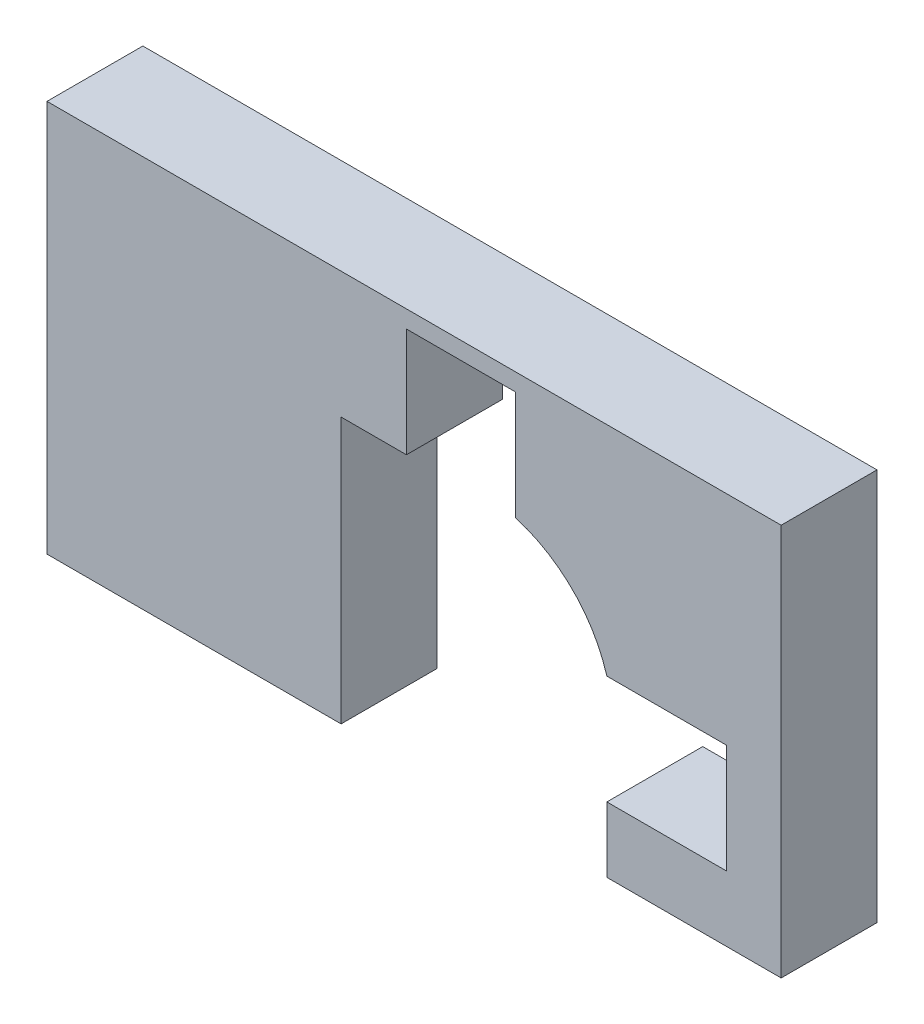
ISO-10303-21;
HEADER;
FILE_DESCRIPTION(('STEP AP214'),'2;1');
FILE_NAME('part.step','',(''),(''),'','','');
FILE_SCHEMA(('AUTOMOTIVE_DESIGN { 1 0 10303 214 1 1 1 1 }'));
ENDSEC;
DATA;
#1=APPLICATION_CONTEXT('core data for automotive mechanical design processes');
#2=APPLICATION_PROTOCOL_DEFINITION('international standard','automotive_design',2000,#1);
#3=PRODUCT_CONTEXT('',#1,'mechanical');
#4=PRODUCT('Part','Part','',(#3));
#5=PRODUCT_RELATED_PRODUCT_CATEGORY('part','',(#4));
#6=PRODUCT_DEFINITION_FORMATION('','',#4);
#7=PRODUCT_DEFINITION_CONTEXT('part definition',#1,'design');
#8=PRODUCT_DEFINITION('design','',#6,#7);
#9=PRODUCT_DEFINITION_SHAPE('','',#8);
#10=(LENGTH_UNIT() NAMED_UNIT(*) SI_UNIT(.MILLI.,.METRE.));
#11=(NAMED_UNIT(*) PLANE_ANGLE_UNIT() SI_UNIT($,.RADIAN.));
#12=(NAMED_UNIT(*) SI_UNIT($,.STERADIAN.) SOLID_ANGLE_UNIT());
#13=UNCERTAINTY_MEASURE_WITH_UNIT(LENGTH_MEASURE(1.E-05),#10,'distance_accuracy_value','');
#14=(GEOMETRIC_REPRESENTATION_CONTEXT(3) GLOBAL_UNCERTAINTY_ASSIGNED_CONTEXT((#13)) GLOBAL_UNIT_ASSIGNED_CONTEXT((#10,
#11,#12)) REPRESENTATION_CONTEXT('',''));
#15=CARTESIAN_POINT('',(0.,0.,0.));
#16=DIRECTION('',(0.,0.,1.));
#17=DIRECTION('',(1.,0.,0.));
#18=AXIS2_PLACEMENT_3D('',#15,#16,#17);
#19=CARTESIAN_POINT('',(-62.5162371902122,-41.3859564980179,44.));
#20=DIRECTION('',(0.,1.,0.));
#21=DIRECTION('',(-1.,0.,0.));
#22=AXIS2_PLACEMENT_3D('',#19,#20,#21);
#23=PLANE('',#22);
#24=DIRECTION('',(1.,0.,0.));
#25=VECTOR('',#24,1.);
#26=CARTESIAN_POINT('',(-62.5162371902122,-41.3859564980179,0.));
#27=LINE('',#26,#25);
#28=CARTESIAN_POINT('',(-197.516237190212,-41.385956498018,0.));
#29=VERTEX_POINT('',#28);
#30=CARTESIAN_POINT('',(-62.5162371902122,-41.3859564980179,0.));
#31=VERTEX_POINT('',#30);
#32=EDGE_CURVE('E171',#29,#31,#27,.T.);
#33=ORIENTED_EDGE('',*,*,#32,.T.);
#34=DIRECTION('',(0.,0.,-1.));
#35=VECTOR('',#34,1.);
#36=CARTESIAN_POINT('',(-62.5162371902122,-41.3859564980179,44.));
#37=LINE('',#36,#35);
#38=CARTESIAN_POINT('',(-62.5162371902122,-41.3859564980179,44.));
#39=VERTEX_POINT('',#38);
#40=EDGE_CURVE('E11',#39,#31,#37,.T.);
#41=ORIENTED_EDGE('',*,*,#40,.F.);
#42=DIRECTION('',(1.,0.,0.));
#43=VECTOR('',#42,1.);
#44=CARTESIAN_POINT('',(-62.5162371902122,-41.3859564980179,44.));
#45=LINE('',#44,#43);
#46=CARTESIAN_POINT('',(-197.516237190212,-41.385956498018,44.));
#47=VERTEX_POINT('',#46);
#48=EDGE_CURVE('E199',#47,#39,#45,.T.);
#49=ORIENTED_EDGE('',*,*,#48,.F.);
#50=DIRECTION('',(0.,0.,-1.));
#51=VECTOR('',#50,1.);
#52=CARTESIAN_POINT('',(-197.516237190212,-41.385956498018,44.));
#53=LINE('',#52,#51);
#54=EDGE_CURVE('E167',#47,#29,#53,.T.);
#55=ORIENTED_EDGE('',*,*,#54,.T.);
#56=EDGE_LOOP('',(#33,#41,#49,#55));
#57=FACE_BOUND('',#56,.T.);
#58=ADVANCED_FACE('F33',(#57),#23,.F.);
#59=CARTESIAN_POINT('',(-62.5162371902122,-41.3859564980179,44.));
#60=DIRECTION('',(-1.,0.,0.));
#61=DIRECTION('',(0.,0.,1.));
#62=AXIS2_PLACEMENT_3D('',#59,#60,#61);
#63=PLANE('',#62);
#64=DIRECTION('',(0.,1.,0.));
#65=VECTOR('',#64,1.);
#66=CARTESIAN_POINT('',(-62.5162371902122,-41.3859564980179,0.));
#67=LINE('',#66,#65);
#68=CARTESIAN_POINT('',(-62.5162371902122,80.6140435019821,0.));
#69=VERTEX_POINT('',#68);
#70=EDGE_CURVE('E174',#31,#69,#67,.T.);
#71=ORIENTED_EDGE('',*,*,#70,.T.);
#72=DIRECTION('',(0.,0.,-1.));
#73=VECTOR('',#72,1.);
#74=CARTESIAN_POINT('',(-62.5162371902122,80.6140435019821,44.));
#75=LINE('',#74,#73);
#76=CARTESIAN_POINT('',(-62.5162371902122,80.6140435019821,44.));
#77=VERTEX_POINT('',#76);
#78=EDGE_CURVE('E41',#77,#69,#75,.T.);
#79=ORIENTED_EDGE('',*,*,#78,.F.);
#80=DIRECTION('',(0.,1.,0.));
#81=VECTOR('',#80,1.);
#82=CARTESIAN_POINT('',(-62.5162371902122,-41.3859564980179,44.));
#83=LINE('',#82,#81);
#84=EDGE_CURVE('E113',#39,#77,#83,.T.);
#85=ORIENTED_EDGE('',*,*,#84,.F.);
#86=ORIENTED_EDGE('',*,*,#40,.T.);
#87=EDGE_LOOP('',(#71,#79,#85,#86));
#88=FACE_BOUND('',#87,.T.);
#89=ADVANCED_FACE('F292',(#88),#63,.F.);
#90=CARTESIAN_POINT('',(-62.5162371902122,80.6140435019821,44.));
#91=DIRECTION('',(0.,1.,0.));
#92=DIRECTION('',(-1.,0.,0.));
#93=AXIS2_PLACEMENT_3D('',#90,#91,#92);
#94=PLANE('',#93);
#95=DIRECTION('',(1.,0.,0.));
#96=VECTOR('',#95,1.);
#97=CARTESIAN_POINT('',(-62.5162371902122,80.6140435019821,0.));
#98=LINE('',#97,#96);
#99=CARTESIAN_POINT('',(-32.5162371902122,80.6140435019821,0.));
#100=VERTEX_POINT('',#99);
#101=EDGE_CURVE('E176',#69,#100,#98,.T.);
#102=ORIENTED_EDGE('',*,*,#101,.T.);
#103=DIRECTION('',(0.,0.,-1.));
#104=VECTOR('',#103,1.);
#105=CARTESIAN_POINT('',(-32.5162371902122,80.6140435019821,44.));
#106=LINE('',#105,#104);
#107=CARTESIAN_POINT('',(-32.5162371902122,80.6140435019821,44.));
#108=VERTEX_POINT('',#107);
#109=EDGE_CURVE('E227',#108,#100,#106,.T.);
#110=ORIENTED_EDGE('',*,*,#109,.F.);
#111=DIRECTION('',(1.,0.,0.));
#112=VECTOR('',#111,1.);
#113=CARTESIAN_POINT('',(-62.5162371902122,80.6140435019821,44.));
#114=LINE('',#113,#112);
#115=EDGE_CURVE('E235',#77,#108,#114,.T.);
#116=ORIENTED_EDGE('',*,*,#115,.F.);
#117=ORIENTED_EDGE('',*,*,#78,.T.);
#118=EDGE_LOOP('',(#102,#110,#116,#117));
#119=FACE_BOUND('',#118,.T.);
#120=ADVANCED_FACE('F233',(#119),#94,.F.);
#121=CARTESIAN_POINT('',(-32.5162371902123,130.614043501982,44.));
#122=DIRECTION('',(-1.,0.,0.));
#123=DIRECTION('',(0.,-1.,0.));
#124=AXIS2_PLACEMENT_3D('',#121,#122,#123);
#125=PLANE('',#124);
#126=DIRECTION('',(0.,1.,0.));
#127=VECTOR('',#126,1.);
#128=CARTESIAN_POINT('',(-32.5162371902123,130.614043501982,0.));
#129=LINE('',#128,#127);
#130=CARTESIAN_POINT('',(-32.5162371902123,130.614043501982,0.));
#131=VERTEX_POINT('',#130);
#132=EDGE_CURVE('E178',#100,#131,#129,.T.);
#133=ORIENTED_EDGE('',*,*,#132,.T.);
#134=DIRECTION('',(0.,0.,-1.));
#135=VECTOR('',#134,1.);
#136=CARTESIAN_POINT('',(-32.5162371902123,130.614043501982,44.));
#137=LINE('',#136,#135);
#138=CARTESIAN_POINT('',(-32.5162371902123,130.614043501982,44.));
#139=VERTEX_POINT('',#138);
#140=EDGE_CURVE('E224',#139,#131,#137,.T.);
#141=ORIENTED_EDGE('',*,*,#140,.F.);
#142=DIRECTION('',(0.,1.,0.));
#143=VECTOR('',#142,1.);
#144=CARTESIAN_POINT('',(-32.5162371902123,130.614043501982,44.));
#145=LINE('',#144,#143);
#146=EDGE_CURVE('E253',#108,#139,#145,.T.);
#147=ORIENTED_EDGE('',*,*,#146,.F.);
#148=ORIENTED_EDGE('',*,*,#109,.T.);
#149=EDGE_LOOP('',(#133,#141,#147,#148));
#150=FACE_BOUND('',#149,.T.);
#151=ADVANCED_FACE('F244',(#150),#125,.F.);
#152=CARTESIAN_POINT('',(-32.5162371902123,130.614043501982,44.));
#153=DIRECTION('',(0.,1.,0.));
#154=DIRECTION('',(-1.,0.,0.));
#155=AXIS2_PLACEMENT_3D('',#152,#153,#154);
#156=PLANE('',#155);
#157=DIRECTION('',(1.,0.,0.));
#158=VECTOR('',#157,1.);
#159=CARTESIAN_POINT('',(-32.5162371902123,130.614043501982,0.));
#160=LINE('',#159,#158);
#161=CARTESIAN_POINT('',(17.4837628097877,130.614043501982,0.));
#162=VERTEX_POINT('',#161);
#163=EDGE_CURVE('E180',#131,#162,#160,.T.);
#164=ORIENTED_EDGE('',*,*,#163,.T.);
#165=DIRECTION('',(0.,0.,-1.));
#166=VECTOR('',#165,1.);
#167=CARTESIAN_POINT('',(17.4837628097877,130.614043501982,44.));
#168=LINE('',#167,#166);
#169=CARTESIAN_POINT('',(17.4837628097877,130.614043501982,44.));
#170=VERTEX_POINT('',#169);
#171=EDGE_CURVE('E221',#170,#162,#168,.T.);
#172=ORIENTED_EDGE('',*,*,#171,.F.);
#173=DIRECTION('',(1.,0.,0.));
#174=VECTOR('',#173,1.);
#175=CARTESIAN_POINT('',(-32.5162371902123,130.614043501982,44.));
#176=LINE('',#175,#174);
#177=EDGE_CURVE('E250',#139,#170,#176,.T.);
#178=ORIENTED_EDGE('',*,*,#177,.F.);
#179=ORIENTED_EDGE('',*,*,#140,.T.);
#180=EDGE_LOOP('',(#164,#172,#178,#179));
#181=FACE_BOUND('',#180,.T.);
#182=ADVANCED_FACE('F248',(#181),#156,.F.);
#183=CARTESIAN_POINT('',(17.4837628097877,130.614043501982,44.));
#184=DIRECTION('',(1.,0.,0.));
#185=DIRECTION('',(0.,0.,-1.));
#186=AXIS2_PLACEMENT_3D('',#183,#184,#185);
#187=PLANE('',#186);
#188=DIRECTION('',(0.,-1.,0.));
#189=VECTOR('',#188,1.);
#190=CARTESIAN_POINT('',(17.4837628097877,130.614043501982,0.));
#191=LINE('',#190,#189);
#192=CARTESIAN_POINT('',(17.4837628097877,80.6140435019821,0.));
#193=VERTEX_POINT('',#192);
#194=EDGE_CURVE('E182',#162,#193,#191,.T.);
#195=ORIENTED_EDGE('',*,*,#194,.T.);
#196=DIRECTION('',(0.,0.,-1.));
#197=VECTOR('',#196,1.);
#198=CARTESIAN_POINT('',(17.4837628097877,80.6140435019821,44.));
#199=LINE('',#198,#197);
#200=CARTESIAN_POINT('',(17.4837628097877,80.6140435019821,44.));
#201=VERTEX_POINT('',#200);
#202=EDGE_CURVE('E218',#201,#193,#199,.T.);
#203=ORIENTED_EDGE('',*,*,#202,.F.);
#204=DIRECTION('',(0.,-1.,0.));
#205=VECTOR('',#204,1.);
#206=CARTESIAN_POINT('',(17.4837628097877,130.614043501982,44.));
#207=LINE('',#206,#205);
#208=EDGE_CURVE('E252',#170,#201,#207,.T.);
#209=ORIENTED_EDGE('',*,*,#208,.F.);
#210=ORIENTED_EDGE('',*,*,#171,.T.);
#211=EDGE_LOOP('',(#195,#203,#209,#210));
#212=FACE_BOUND('',#211,.T.);
#213=ADVANCED_FACE('F305',(#212),#187,.F.);
#214=CARTESIAN_POINT('',(0.,21.1302806921944,44.));
#215=DIRECTION('',(0.,0.,-1.));
#216=DIRECTION('',(-1.,0.,0.));
#217=AXIS2_PLACEMENT_3D('',#214,#215,#216);
#218=CYLINDRICAL_SURFACE('',#217,62.);
#219=CARTESIAN_POINT('',(0.,21.1302806921944,0.));
#220=DIRECTION('',(0.,0.,-1.));
#221=DIRECTION('',(-1.,0.,0.));
#222=AXIS2_PLACEMENT_3D('',#219,#220,#221);
#223=CIRCLE('',#222,62.);
#224=CARTESIAN_POINT('',(59.4837628097877,38.6140435019821,0.));
#225=VERTEX_POINT('',#224);
#226=EDGE_CURVE('E184',#193,#225,#223,.T.);
#227=ORIENTED_EDGE('',*,*,#226,.T.);
#228=DIRECTION('',(0.,0.,-1.));
#229=VECTOR('',#228,1.);
#230=CARTESIAN_POINT('',(59.4837628097877,38.6140435019821,44.));
#231=LINE('',#230,#229);
#232=CARTESIAN_POINT('',(59.4837628097877,38.6140435019821,44.));
#233=VERTEX_POINT('',#232);
#234=EDGE_CURVE('E215',#233,#225,#231,.T.);
#235=ORIENTED_EDGE('',*,*,#234,.F.);
#236=CARTESIAN_POINT('',(0.,21.1302806921944,44.));
#237=DIRECTION('',(0.,0.,-1.));
#238=DIRECTION('',(-1.,0.,0.));
#239=AXIS2_PLACEMENT_3D('',#236,#237,#238);
#240=CIRCLE('',#239,62.);
#241=EDGE_CURVE('E255',#201,#233,#240,.T.);
#242=ORIENTED_EDGE('',*,*,#241,.F.);
#243=ORIENTED_EDGE('',*,*,#202,.T.);
#244=EDGE_LOOP('',(#227,#235,#242,#243));
#245=FACE_BOUND('',#244,.T.);
#246=ADVANCED_FACE('F308',(#245),#218,.F.);
#247=CARTESIAN_POINT('',(59.4837628097877,38.6140435019821,44.));
#248=DIRECTION('',(0.,1.,0.));
#249=DIRECTION('',(-1.,0.,0.));
#250=AXIS2_PLACEMENT_3D('',#247,#248,#249);
#251=PLANE('',#250);
#252=DIRECTION('',(1.,0.,0.));
#253=VECTOR('',#252,1.);
#254=CARTESIAN_POINT('',(59.4837628097877,38.6140435019821,0.));
#255=LINE('',#254,#253);
#256=CARTESIAN_POINT('',(114.483762809788,38.6140435019821,0.));
#257=VERTEX_POINT('',#256);
#258=EDGE_CURVE('E186',#225,#257,#255,.T.);
#259=ORIENTED_EDGE('',*,*,#258,.T.);
#260=DIRECTION('',(0.,0.,-1.));
#261=VECTOR('',#260,1.);
#262=CARTESIAN_POINT('',(114.483762809788,38.6140435019821,44.));
#263=LINE('',#262,#261);
#264=CARTESIAN_POINT('',(114.483762809788,38.6140435019821,44.));
#265=VERTEX_POINT('',#264);
#266=EDGE_CURVE('E212',#265,#257,#263,.T.);
#267=ORIENTED_EDGE('',*,*,#266,.F.);
#268=DIRECTION('',(1.,0.,0.));
#269=VECTOR('',#268,1.);
#270=CARTESIAN_POINT('',(59.4837628097877,38.6140435019821,44.));
#271=LINE('',#270,#269);
#272=EDGE_CURVE('E261',#233,#265,#271,.T.);
#273=ORIENTED_EDGE('',*,*,#272,.F.);
#274=ORIENTED_EDGE('',*,*,#234,.T.);
#275=EDGE_LOOP('',(#259,#267,#273,#274));
#276=FACE_BOUND('',#275,.T.);
#277=ADVANCED_FACE('F312',(#276),#251,.F.);
#278=CARTESIAN_POINT('',(114.483762809788,38.6140435019821,44.));
#279=DIRECTION('',(1.,0.,0.));
#280=DIRECTION('',(0.,0.,-1.));
#281=AXIS2_PLACEMENT_3D('',#278,#279,#280);
#282=PLANE('',#281);
#283=DIRECTION('',(0.,-1.,0.));
#284=VECTOR('',#283,1.);
#285=CARTESIAN_POINT('',(114.483762809788,38.6140435019821,0.));
#286=LINE('',#285,#284);
#287=CARTESIAN_POINT('',(114.483762809788,-11.3859564980179,0.));
#288=VERTEX_POINT('',#287);
#289=EDGE_CURVE('E188',#257,#288,#286,.T.);
#290=ORIENTED_EDGE('',*,*,#289,.T.);
#291=DIRECTION('',(0.,0.,-1.));
#292=VECTOR('',#291,1.);
#293=CARTESIAN_POINT('',(114.483762809788,-11.3859564980179,44.));
#294=LINE('',#293,#292);
#295=CARTESIAN_POINT('',(114.483762809788,-11.3859564980179,44.));
#296=VERTEX_POINT('',#295);
#297=EDGE_CURVE('E209',#296,#288,#294,.T.);
#298=ORIENTED_EDGE('',*,*,#297,.F.);
#299=DIRECTION('',(0.,-1.,0.));
#300=VECTOR('',#299,1.);
#301=CARTESIAN_POINT('',(114.483762809788,38.6140435019821,44.));
#302=LINE('',#301,#300);
#303=EDGE_CURVE('E263',#265,#296,#302,.T.);
#304=ORIENTED_EDGE('',*,*,#303,.F.);
#305=ORIENTED_EDGE('',*,*,#266,.T.);
#306=EDGE_LOOP('',(#290,#298,#304,#305));
#307=FACE_BOUND('',#306,.T.);
#308=ADVANCED_FACE('F316',(#307),#282,.F.);
#309=CARTESIAN_POINT('',(114.483762809788,-11.3859564980179,44.));
#310=DIRECTION('',(0.,-1.,0.));
#311=DIRECTION('',(1.,0.,0.));
#312=AXIS2_PLACEMENT_3D('',#309,#310,#311);
#313=PLANE('',#312);
#314=DIRECTION('',(-1.,0.,0.));
#315=VECTOR('',#314,1.);
#316=CARTESIAN_POINT('',(114.483762809788,-11.3859564980179,0.));
#317=LINE('',#316,#315);
#318=CARTESIAN_POINT('',(59.4837628097877,-11.3859564980179,0.));
#319=VERTEX_POINT('',#318);
#320=EDGE_CURVE('E190',#288,#319,#317,.T.);
#321=ORIENTED_EDGE('',*,*,#320,.T.);
#322=DIRECTION('',(0.,0.,-1.));
#323=VECTOR('',#322,1.);
#324=CARTESIAN_POINT('',(59.4837628097877,-11.3859564980179,44.));
#325=LINE('',#324,#323);
#326=CARTESIAN_POINT('',(59.4837628097877,-11.3859564980179,44.));
#327=VERTEX_POINT('',#326);
#328=EDGE_CURVE('E206',#327,#319,#325,.T.);
#329=ORIENTED_EDGE('',*,*,#328,.F.);
#330=DIRECTION('',(-1.,0.,0.));
#331=VECTOR('',#330,1.);
#332=CARTESIAN_POINT('',(114.483762809788,-11.3859564980179,44.));
#333=LINE('',#332,#331);
#334=EDGE_CURVE('E265',#296,#327,#333,.T.);
#335=ORIENTED_EDGE('',*,*,#334,.F.);
#336=ORIENTED_EDGE('',*,*,#297,.T.);
#337=EDGE_LOOP('',(#321,#329,#335,#336));
#338=FACE_BOUND('',#337,.T.);
#339=ADVANCED_FACE('F320',(#338),#313,.F.);
#340=CARTESIAN_POINT('',(59.4837628097877,-11.3859564980179,44.));
#341=DIRECTION('',(1.,0.,0.));
#342=DIRECTION('',(0.,0.,-1.));
#343=AXIS2_PLACEMENT_3D('',#340,#341,#342);
#344=PLANE('',#343);
#345=DIRECTION('',(0.,-1.,0.));
#346=VECTOR('',#345,1.);
#347=CARTESIAN_POINT('',(59.4837628097877,-11.3859564980179,0.));
#348=LINE('',#347,#346);
#349=CARTESIAN_POINT('',(59.4837628097877,-41.3859564980179,0.));
#350=VERTEX_POINT('',#349);
#351=EDGE_CURVE('E192',#319,#350,#348,.T.);
#352=ORIENTED_EDGE('',*,*,#351,.T.);
#353=DIRECTION('',(0.,0.,-1.));
#354=VECTOR('',#353,1.);
#355=CARTESIAN_POINT('',(59.4837628097877,-41.3859564980179,44.));
#356=LINE('',#355,#354);
#357=CARTESIAN_POINT('',(59.4837628097877,-41.3859564980179,44.));
#358=VERTEX_POINT('',#357);
#359=EDGE_CURVE('E203',#358,#350,#356,.T.);
#360=ORIENTED_EDGE('',*,*,#359,.F.);
#361=DIRECTION('',(0.,-1.,0.));
#362=VECTOR('',#361,1.);
#363=CARTESIAN_POINT('',(59.4837628097877,-11.3859564980179,44.));
#364=LINE('',#363,#362);
#365=EDGE_CURVE('E267',#327,#358,#364,.T.);
#366=ORIENTED_EDGE('',*,*,#365,.F.);
#367=ORIENTED_EDGE('',*,*,#328,.T.);
#368=EDGE_LOOP('',(#352,#360,#366,#367));
#369=FACE_BOUND('',#368,.T.);
#370=ADVANCED_FACE('F273',(#369),#344,.F.);
#371=CARTESIAN_POINT('',(59.4837628097877,-41.3859564980179,44.));
#372=DIRECTION('',(0.,1.,0.));
#373=DIRECTION('',(0.,0.,1.));
#374=AXIS2_PLACEMENT_3D('',#371,#372,#373);
#375=PLANE('',#374);
#376=DIRECTION('',(1.,0.,0.));
#377=VECTOR('',#376,1.);
#378=CARTESIAN_POINT('',(59.4837628097877,-41.3859564980179,0.));
#379=LINE('',#378,#377);
#380=CARTESIAN_POINT('',(139.483762809788,-41.3859564980179,0.));
#381=VERTEX_POINT('',#380);
#382=EDGE_CURVE('E194',#350,#381,#379,.T.);
#383=ORIENTED_EDGE('',*,*,#382,.T.);
#384=DIRECTION('',(0.,0.,-1.));
#385=VECTOR('',#384,1.);
#386=CARTESIAN_POINT('',(139.483762809788,-41.3859564980179,44.));
#387=LINE('',#386,#385);
#388=CARTESIAN_POINT('',(139.483762809788,-41.3859564980179,44.));
#389=VERTEX_POINT('',#388);
#390=EDGE_CURVE('E162',#389,#381,#387,.T.);
#391=ORIENTED_EDGE('',*,*,#390,.F.);
#392=DIRECTION('',(1.,0.,0.));
#393=VECTOR('',#392,1.);
#394=CARTESIAN_POINT('',(59.4837628097877,-41.3859564980179,44.));
#395=LINE('',#394,#393);
#396=EDGE_CURVE('E153',#358,#389,#395,.T.);
#397=ORIENTED_EDGE('',*,*,#396,.F.);
#398=ORIENTED_EDGE('',*,*,#359,.T.);
#399=EDGE_LOOP('',(#383,#391,#397,#398));
#400=FACE_BOUND('',#399,.T.);
#401=ADVANCED_FACE('F277',(#400),#375,.F.);
#402=CARTESIAN_POINT('',(139.483762809788,138.614043501982,44.));
#403=DIRECTION('',(-1.,0.,0.));
#404=DIRECTION('',(0.,0.,1.));
#405=AXIS2_PLACEMENT_3D('',#402,#403,#404);
#406=PLANE('',#405);
#407=DIRECTION('',(0.,1.,0.));
#408=VECTOR('',#407,1.);
#409=CARTESIAN_POINT('',(139.483762809788,138.614043501982,0.));
#410=LINE('',#409,#408);
#411=CARTESIAN_POINT('',(139.483762809788,138.614043501982,0.));
#412=VERTEX_POINT('',#411);
#413=EDGE_CURVE('E161',#381,#412,#410,.T.);
#414=ORIENTED_EDGE('',*,*,#413,.T.);
#415=DIRECTION('',(0.,0.,-1.));
#416=VECTOR('',#415,1.);
#417=CARTESIAN_POINT('',(139.483762809788,138.614043501982,44.));
#418=LINE('',#417,#416);
#419=CARTESIAN_POINT('',(139.483762809788,138.614043501982,44.));
#420=VERTEX_POINT('',#419);
#421=EDGE_CURVE('E158',#420,#412,#418,.T.);
#422=ORIENTED_EDGE('',*,*,#421,.F.);
#423=DIRECTION('',(0.,1.,0.));
#424=VECTOR('',#423,1.);
#425=CARTESIAN_POINT('',(139.483762809788,138.614043501982,44.));
#426=LINE('',#425,#424);
#427=EDGE_CURVE('E147',#389,#420,#426,.T.);
#428=ORIENTED_EDGE('',*,*,#427,.F.);
#429=ORIENTED_EDGE('',*,*,#390,.T.);
#430=EDGE_LOOP('',(#414,#422,#428,#429));
#431=FACE_BOUND('',#430,.T.);
#432=ADVANCED_FACE('F159',(#431),#406,.F.);
#433=CARTESIAN_POINT('',(-197.516237190212,138.614043501982,44.));
#434=DIRECTION('',(0.,-1.,0.));
#435=DIRECTION('',(1.,0.,0.));
#436=AXIS2_PLACEMENT_3D('',#433,#434,#435);
#437=PLANE('',#436);
#438=DIRECTION('',(-1.,0.,0.));
#439=VECTOR('',#438,1.);
#440=CARTESIAN_POINT('',(-197.516237190212,138.614043501982,0.));
#441=LINE('',#440,#439);
#442=CARTESIAN_POINT('',(-197.516237190212,138.614043501982,0.));
#443=VERTEX_POINT('',#442);
#444=EDGE_CURVE('E99',#412,#443,#441,.T.);
#445=ORIENTED_EDGE('',*,*,#444,.T.);
#446=DIRECTION('',(0.,0.,-1.));
#447=VECTOR('',#446,1.);
#448=CARTESIAN_POINT('',(-197.516237190212,138.614043501982,44.));
#449=LINE('',#448,#447);
#450=CARTESIAN_POINT('',(-197.516237190212,138.614043501982,44.));
#451=VERTEX_POINT('',#450);
#452=EDGE_CURVE('E163',#451,#443,#449,.T.);
#453=ORIENTED_EDGE('',*,*,#452,.F.);
#454=DIRECTION('',(-1.,0.,0.));
#455=VECTOR('',#454,1.);
#456=CARTESIAN_POINT('',(-197.516237190212,138.614043501982,44.));
#457=LINE('',#456,#455);
#458=EDGE_CURVE('E151',#420,#451,#457,.T.);
#459=ORIENTED_EDGE('',*,*,#458,.F.);
#460=ORIENTED_EDGE('',*,*,#421,.T.);
#461=EDGE_LOOP('',(#445,#453,#459,#460));
#462=FACE_BOUND('',#461,.T.);
#463=ADVANCED_FACE('F165',(#462),#437,.F.);
#464=CARTESIAN_POINT('',(-197.516237190212,138.614043501982,44.));
#465=DIRECTION('',(1.,0.,0.));
#466=DIRECTION('',(0.,0.,-1.));
#467=AXIS2_PLACEMENT_3D('',#464,#465,#466);
#468=PLANE('',#467);
#469=DIRECTION('',(0.,-1.,0.));
#470=VECTOR('',#469,1.);
#471=CARTESIAN_POINT('',(-197.516237190212,138.614043501982,0.));
#472=LINE('',#471,#470);
#473=EDGE_CURVE('E105',#443,#29,#472,.T.);
#474=ORIENTED_EDGE('',*,*,#473,.T.);
#475=ORIENTED_EDGE('',*,*,#54,.F.);
#476=DIRECTION('',(0.,-1.,0.));
#477=VECTOR('',#476,1.);
#478=CARTESIAN_POINT('',(-197.516237190212,138.614043501982,44.));
#479=LINE('',#478,#477);
#480=EDGE_CURVE('E49',#451,#47,#479,.T.);
#481=ORIENTED_EDGE('',*,*,#480,.F.);
#482=ORIENTED_EDGE('',*,*,#452,.T.);
#483=EDGE_LOOP('',(#474,#475,#481,#482));
#484=FACE_BOUND('',#483,.T.);
#485=ADVANCED_FACE('F281',(#484),#468,.F.);
#486=CARTESIAN_POINT('',(0.,21.1302806921944,44.));
#487=DIRECTION('',(0.,0.,-1.));
#488=DIRECTION('',(-1.,0.,0.));
#489=AXIS2_PLACEMENT_3D('',#486,#487,#488);
#490=PLANE('',#489);
#491=ORIENTED_EDGE('',*,*,#48,.T.);
#492=ORIENTED_EDGE('',*,*,#84,.T.);
#493=ORIENTED_EDGE('',*,*,#115,.T.);
#494=ORIENTED_EDGE('',*,*,#146,.T.);
#495=ORIENTED_EDGE('',*,*,#177,.T.);
#496=ORIENTED_EDGE('',*,*,#208,.T.);
#497=ORIENTED_EDGE('',*,*,#241,.T.);
#498=ORIENTED_EDGE('',*,*,#272,.T.);
#499=ORIENTED_EDGE('',*,*,#303,.T.);
#500=ORIENTED_EDGE('',*,*,#334,.T.);
#501=ORIENTED_EDGE('',*,*,#365,.T.);
#502=ORIENTED_EDGE('',*,*,#396,.T.);
#503=ORIENTED_EDGE('',*,*,#427,.T.);
#504=ORIENTED_EDGE('',*,*,#458,.T.);
#505=ORIENTED_EDGE('',*,*,#480,.T.);
#506=EDGE_LOOP('',(#491,#492,#493,#494,#495,#496,#497,#498,#499,#500,#501,#502,#503,#504,#505));
#507=FACE_BOUND('',#506,.T.);
#508=ADVANCED_FACE('F149',(#507),#490,.F.);
#509=CARTESIAN_POINT('',(0.,21.1302806921944,0.));
#510=DIRECTION('',(0.,0.,-1.));
#511=DIRECTION('',(-1.,0.,0.));
#512=AXIS2_PLACEMENT_3D('',#509,#510,#511);
#513=PLANE('',#512);
#514=ORIENTED_EDGE('',*,*,#32,.F.);
#515=ORIENTED_EDGE('',*,*,#473,.F.);
#516=ORIENTED_EDGE('',*,*,#444,.F.);
#517=ORIENTED_EDGE('',*,*,#413,.F.);
#518=ORIENTED_EDGE('',*,*,#382,.F.);
#519=ORIENTED_EDGE('',*,*,#351,.F.);
#520=ORIENTED_EDGE('',*,*,#320,.F.);
#521=ORIENTED_EDGE('',*,*,#289,.F.);
#522=ORIENTED_EDGE('',*,*,#258,.F.);
#523=ORIENTED_EDGE('',*,*,#226,.F.);
#524=ORIENTED_EDGE('',*,*,#194,.F.);
#525=ORIENTED_EDGE('',*,*,#163,.F.);
#526=ORIENTED_EDGE('',*,*,#132,.F.);
#527=ORIENTED_EDGE('',*,*,#101,.F.);
#528=ORIENTED_EDGE('',*,*,#70,.F.);
#529=EDGE_LOOP('',(#514,#515,#516,#517,#518,#519,#520,#521,#522,#523,#524,#525,#526,#527,#528));
#530=FACE_BOUND('',#529,.T.);
#531=ADVANCED_FACE('F239',(#530),#513,.T.);
#532=CLOSED_SHELL('',(#58,#89,#120,#151,#182,#213,#246,#277,#308,#339,#370,#401,#432,#463,#485,
#508,#531));
#533=MANIFOLD_SOLID_BREP('B2',#532);
#534=ADVANCED_BREP_SHAPE_REPRESENTATION('',(#18,#533),#14);
#535=SHAPE_DEFINITION_REPRESENTATION(#9,#534);
ENDSEC;
END-ISO-10303-21;
